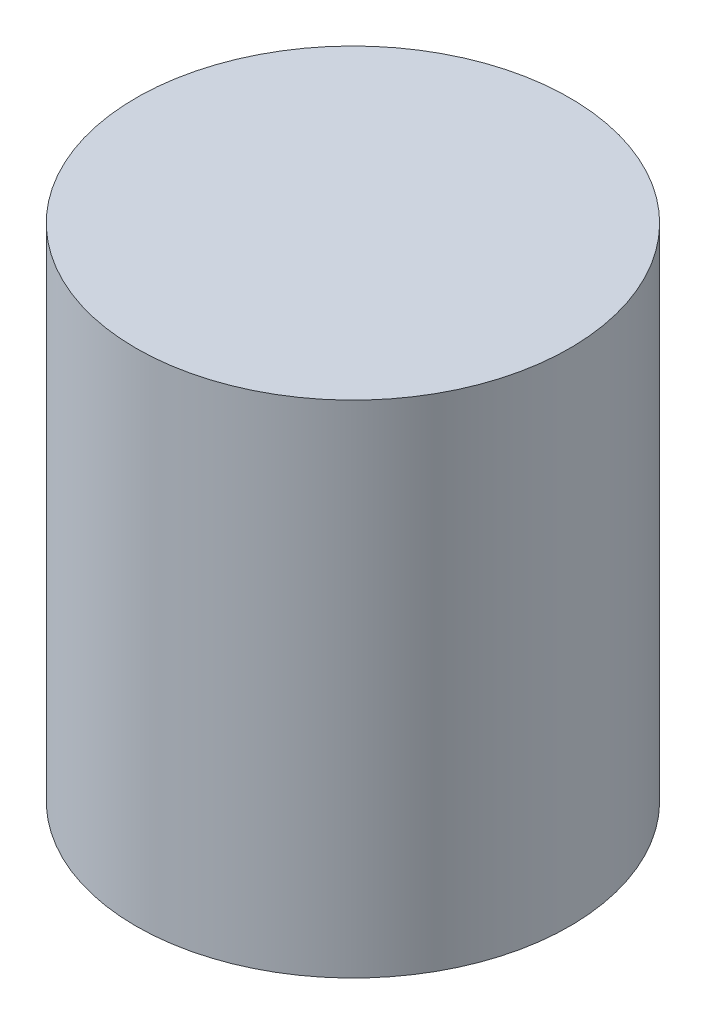
ISO-10303-21;
HEADER;
FILE_DESCRIPTION(('STEP AP214'),'2;1');
FILE_NAME('part.step','',(''),(''),'','','');
FILE_SCHEMA(('AUTOMOTIVE_DESIGN { 1 0 10303 214 1 1 1 1 }'));
ENDSEC;
DATA;
#1=APPLICATION_CONTEXT('core data for automotive mechanical design processes');
#2=APPLICATION_PROTOCOL_DEFINITION('international standard','automotive_design',2000,#1);
#3=PRODUCT_CONTEXT('',#1,'mechanical');
#4=PRODUCT('Part','Part','',(#3));
#5=PRODUCT_RELATED_PRODUCT_CATEGORY('part','',(#4));
#6=PRODUCT_DEFINITION_FORMATION('','',#4);
#7=PRODUCT_DEFINITION_CONTEXT('part definition',#1,'design');
#8=PRODUCT_DEFINITION('design','',#6,#7);
#9=PRODUCT_DEFINITION_SHAPE('','',#8);
#10=(LENGTH_UNIT() NAMED_UNIT(*) SI_UNIT(.MILLI.,.METRE.));
#11=(NAMED_UNIT(*) PLANE_ANGLE_UNIT() SI_UNIT($,.RADIAN.));
#12=(NAMED_UNIT(*) SI_UNIT($,.STERADIAN.) SOLID_ANGLE_UNIT());
#13=UNCERTAINTY_MEASURE_WITH_UNIT(LENGTH_MEASURE(1.E-05),#10,'distance_accuracy_value','');
#14=(GEOMETRIC_REPRESENTATION_CONTEXT(3) GLOBAL_UNCERTAINTY_ASSIGNED_CONTEXT((#13)) GLOBAL_UNIT_ASSIGNED_CONTEXT((#10,
#11,#12)) REPRESENTATION_CONTEXT('',''));
#15=CARTESIAN_POINT('',(0.,0.,0.));
#16=DIRECTION('',(0.,0.,1.));
#17=DIRECTION('',(1.,0.,0.));
#18=AXIS2_PLACEMENT_3D('',#15,#16,#17);
#19=CARTESIAN_POINT('',(0.,-300.,0.));
#20=DIRECTION('',(0.,1.,0.));
#21=DIRECTION('',(0.,0.,1.));
#22=AXIS2_PLACEMENT_3D('',#19,#20,#21);
#23=CYLINDRICAL_SURFACE('',#22,130.);
#24=CARTESIAN_POINT('',(0.,-300.,0.));
#25=DIRECTION('',(0.,1.,0.));
#26=DIRECTION('',(0.,0.,1.));
#27=AXIS2_PLACEMENT_3D('',#24,#25,#26);
#28=CIRCLE('',#27,130.);
#29=CARTESIAN_POINT('',(0.,-300.,130.));
#30=VERTEX_POINT('',#29);
#31=EDGE_CURVE('E10',#30,#30,#28,.T.);
#32=ORIENTED_EDGE('',*,*,#31,.T.);
#33=EDGE_LOOP('',(#32));
#34=FACE_BOUND('',#33,.T.);
#35=CARTESIAN_POINT('',(0.,0.,0.));
#36=DIRECTION('',(0.,1.,0.));
#37=DIRECTION('',(0.,0.,1.));
#38=AXIS2_PLACEMENT_3D('',#35,#36,#37);
#39=CIRCLE('',#38,130.);
#40=CARTESIAN_POINT('',(0.,0.,130.));
#41=VERTEX_POINT('',#40);
#42=EDGE_CURVE('E33',#41,#41,#39,.T.);
#43=ORIENTED_EDGE('',*,*,#42,.F.);
#44=EDGE_LOOP('',(#43));
#45=FACE_BOUND('',#44,.T.);
#46=ADVANCED_FACE('F30',(#34,#45),#23,.T.);
#47=CARTESIAN_POINT('',(0.,-300.,0.));
#48=DIRECTION('',(0.,1.,0.));
#49=DIRECTION('',(0.,0.,1.));
#50=AXIS2_PLACEMENT_3D('',#47,#48,#49);
#51=PLANE('',#50);
#52=CARTESIAN_POINT('',(0.,-300.,0.));
#53=DIRECTION('',(0.,-1.,0.));
#54=DIRECTION('',(0.,0.,-1.));
#55=AXIS2_PLACEMENT_3D('',#52,#53,#54);
#56=CIRCLE('',#55,125.);
#57=CARTESIAN_POINT('',(0.,-300.,-125.));
#58=VERTEX_POINT('',#57);
#59=EDGE_CURVE('E42',#58,#58,#56,.T.);
#60=ORIENTED_EDGE('',*,*,#59,.F.);
#61=EDGE_LOOP('',(#60));
#62=FACE_BOUND('',#61,.T.);
#63=ORIENTED_EDGE('',*,*,#31,.F.);
#64=EDGE_LOOP('',(#63));
#65=FACE_BOUND('',#64,.T.);
#66=ADVANCED_FACE('F57',(#62,#65),#51,.F.);
#67=CARTESIAN_POINT('',(0.,0.,0.));
#68=DIRECTION('',(0.,1.,0.));
#69=DIRECTION('',(0.,0.,1.));
#70=AXIS2_PLACEMENT_3D('',#67,#68,#69);
#71=PLANE('',#70);
#72=ORIENTED_EDGE('',*,*,#42,.T.);
#73=EDGE_LOOP('',(#72));
#74=FACE_BOUND('',#73,.T.);
#75=ADVANCED_FACE('F53',(#74),#71,.T.);
#76=CARTESIAN_POINT('',(0.,-20.,0.));
#77=DIRECTION('',(0.,-1.,0.));
#78=DIRECTION('',(0.,0.,-1.));
#79=AXIS2_PLACEMENT_3D('',#76,#77,#78);
#80=CYLINDRICAL_SURFACE('',#79,125.);
#81=CARTESIAN_POINT('',(0.,-20.,0.));
#82=DIRECTION('',(0.,-1.,0.));
#83=DIRECTION('',(0.,0.,-1.));
#84=AXIS2_PLACEMENT_3D('',#81,#82,#83);
#85=CIRCLE('',#84,125.);
#86=CARTESIAN_POINT('',(0.,-20.,-125.));
#87=VERTEX_POINT('',#86);
#88=EDGE_CURVE('E40',#87,#87,#85,.T.);
#89=ORIENTED_EDGE('',*,*,#88,.F.);
#90=EDGE_LOOP('',(#89));
#91=FACE_BOUND('',#90,.T.);
#92=ORIENTED_EDGE('',*,*,#59,.T.);
#93=EDGE_LOOP('',(#92));
#94=FACE_BOUND('',#93,.T.);
#95=ADVANCED_FACE('F50',(#91,#94),#80,.F.);
#96=CARTESIAN_POINT('',(0.,-20.,0.));
#97=DIRECTION('',(0.,-1.,0.));
#98=DIRECTION('',(0.,0.,-1.));
#99=AXIS2_PLACEMENT_3D('',#96,#97,#98);
#100=PLANE('',#99);
#101=ORIENTED_EDGE('',*,*,#88,.T.);
#102=EDGE_LOOP('',(#101));
#103=FACE_BOUND('',#102,.T.);
#104=ADVANCED_FACE('F48',(#103),#100,.T.);
#105=CLOSED_SHELL('',(#46,#66,#75,#95,#104));
#106=MANIFOLD_SOLID_BREP('B2',#105);
#107=ADVANCED_BREP_SHAPE_REPRESENTATION('',(#18,#106),#14);
#108=SHAPE_DEFINITION_REPRESENTATION(#9,#107);
ENDSEC;
END-ISO-10303-21;
